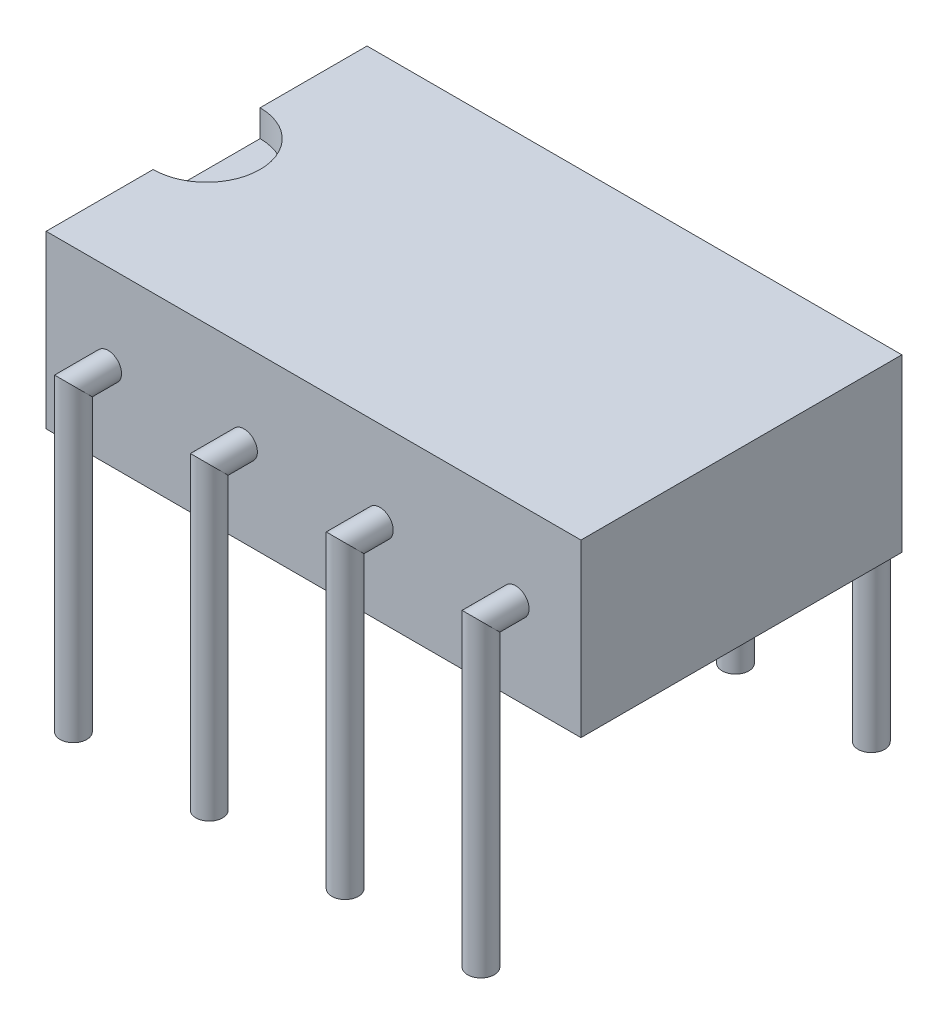
ISO-10303-21;
HEADER;
FILE_DESCRIPTION(('STEP AP214'),'2;1');
FILE_NAME('part.step','',(''),(''),'','','');
FILE_SCHEMA(('AUTOMOTIVE_DESIGN { 1 0 10303 214 1 1 1 1 }'));
ENDSEC;
DATA;
#1=APPLICATION_CONTEXT('core data for automotive mechanical design processes');
#2=APPLICATION_PROTOCOL_DEFINITION('international standard','automotive_design',2000,#1);
#3=PRODUCT_CONTEXT('',#1,'mechanical');
#4=PRODUCT('Part','Part','',(#3));
#5=PRODUCT_RELATED_PRODUCT_CATEGORY('part','',(#4));
#6=PRODUCT_DEFINITION_FORMATION('','',#4);
#7=PRODUCT_DEFINITION_CONTEXT('part definition',#1,'design');
#8=PRODUCT_DEFINITION('design','',#6,#7);
#9=PRODUCT_DEFINITION_SHAPE('','',#8);
#10=(LENGTH_UNIT() NAMED_UNIT(*) SI_UNIT(.MILLI.,.METRE.));
#11=(NAMED_UNIT(*) PLANE_ANGLE_UNIT() SI_UNIT($,.RADIAN.));
#12=(NAMED_UNIT(*) SI_UNIT($,.STERADIAN.) SOLID_ANGLE_UNIT());
#13=UNCERTAINTY_MEASURE_WITH_UNIT(LENGTH_MEASURE(1.E-05),#10,'distance_accuracy_value','');
#14=(GEOMETRIC_REPRESENTATION_CONTEXT(3) GLOBAL_UNCERTAINTY_ASSIGNED_CONTEXT((#13)) GLOBAL_UNIT_ASSIGNED_CONTEXT((#10,
#11,#12)) REPRESENTATION_CONTEXT('',''));
#15=CARTESIAN_POINT('',(0.,0.,0.));
#16=DIRECTION('',(0.,0.,1.));
#17=DIRECTION('',(1.,0.,0.));
#18=AXIS2_PLACEMENT_3D('',#15,#16,#17);
#19=CARTESIAN_POINT('',(10.,3.2,3.));
#20=DIRECTION('',(0.,0.,-1.));
#21=DIRECTION('',(-1.,0.,0.));
#22=AXIS2_PLACEMENT_3D('',#19,#20,#21);
#23=PLANE('',#22);
#24=CARTESIAN_POINT('',(6.24,1.6,3.));
#25=DIRECTION('',(0.,0.,-1.));
#26=DIRECTION('',(-1.,0.,0.));
#27=AXIS2_PLACEMENT_3D('',#24,#25,#26);
#28=CIRCLE('',#27,0.25);
#29=CARTESIAN_POINT('',(5.99,1.6,3.));
#30=VERTEX_POINT('',#29);
#31=EDGE_CURVE('E41',#30,#30,#28,.F.);
#32=ORIENTED_EDGE('',*,*,#31,.F.);
#33=EDGE_LOOP('',(#32));
#34=FACE_BOUND('',#33,.T.);
#35=CARTESIAN_POINT('',(1.16,1.6,3.));
#36=DIRECTION('',(0.,0.,1.));
#37=DIRECTION('',(1.,0.,0.));
#38=AXIS2_PLACEMENT_3D('',#35,#36,#37);
#39=CIRCLE('',#38,0.25);
#40=CARTESIAN_POINT('',(1.41,1.6,3.));
#41=VERTEX_POINT('',#40);
#42=EDGE_CURVE('E132',#41,#41,#39,.T.);
#43=ORIENTED_EDGE('',*,*,#42,.F.);
#44=EDGE_LOOP('',(#43));
#45=FACE_BOUND('',#44,.T.);
#46=DIRECTION('',(0.,-1.,0.));
#47=VECTOR('',#46,1.);
#48=CARTESIAN_POINT('',(0.,3.2,3.));
#49=LINE('',#48,#47);
#50=CARTESIAN_POINT('',(0.,3.2,3.));
#51=VERTEX_POINT('',#50);
#52=CARTESIAN_POINT('',(0.,0.,3.));
#53=VERTEX_POINT('',#52);
#54=EDGE_CURVE('E151',#51,#53,#49,.T.);
#55=ORIENTED_EDGE('',*,*,#54,.T.);
#56=DIRECTION('',(-1.,0.,0.));
#57=VECTOR('',#56,1.);
#58=CARTESIAN_POINT('',(10.,0.,3.));
#59=LINE('',#58,#57);
#60=CARTESIAN_POINT('',(10.,0.,3.));
#61=VERTEX_POINT('',#60);
#62=EDGE_CURVE('E129',#61,#53,#59,.T.);
#63=ORIENTED_EDGE('',*,*,#62,.F.);
#64=DIRECTION('',(0.,-1.,0.));
#65=VECTOR('',#64,1.);
#66=CARTESIAN_POINT('',(10.,3.2,3.));
#67=LINE('',#66,#65);
#68=CARTESIAN_POINT('',(10.,3.2,3.));
#69=VERTEX_POINT('',#68);
#70=EDGE_CURVE('E109',#69,#61,#67,.T.);
#71=ORIENTED_EDGE('',*,*,#70,.F.);
#72=DIRECTION('',(-1.,0.,0.));
#73=VECTOR('',#72,1.);
#74=CARTESIAN_POINT('',(10.,3.2,3.));
#75=LINE('',#74,#73);
#76=EDGE_CURVE('E122',#69,#51,#75,.T.);
#77=ORIENTED_EDGE('',*,*,#76,.T.);
#78=EDGE_LOOP('',(#55,#63,#71,#77));
#79=FACE_BOUND('',#78,.T.);
#80=CARTESIAN_POINT('',(3.7,1.6,3.));
#81=DIRECTION('',(0.,0.,-1.));
#82=DIRECTION('',(-1.,0.,0.));
#83=AXIS2_PLACEMENT_3D('',#80,#81,#82);
#84=CIRCLE('',#83,0.25);
#85=CARTESIAN_POINT('',(3.45,1.6,3.));
#86=VERTEX_POINT('',#85);
#87=EDGE_CURVE('E133',#86,#86,#84,.F.);
#88=ORIENTED_EDGE('',*,*,#87,.F.);
#89=EDGE_LOOP('',(#88));
#90=FACE_BOUND('',#89,.T.);
#91=CARTESIAN_POINT('',(8.78,1.6,3.));
#92=DIRECTION('',(0.,0.,-1.));
#93=DIRECTION('',(-1.,0.,0.));
#94=AXIS2_PLACEMENT_3D('',#91,#92,#93);
#95=CIRCLE('',#94,0.25);
#96=CARTESIAN_POINT('',(8.53,1.6,3.));
#97=VERTEX_POINT('',#96);
#98=EDGE_CURVE('E12',#97,#97,#95,.F.);
#99=ORIENTED_EDGE('',*,*,#98,.F.);
#100=EDGE_LOOP('',(#99));
#101=FACE_BOUND('',#100,.T.);
#102=ADVANCED_FACE('F34',(#34,#45,#79,#90,#101),#23,.F.);
#103=CARTESIAN_POINT('',(10.,0.,3.));
#104=DIRECTION('',(0.,1.,0.));
#105=DIRECTION('',(0.,0.,1.));
#106=AXIS2_PLACEMENT_3D('',#103,#104,#105);
#107=PLANE('',#106);
#108=DIRECTION('',(0.,0.,-1.));
#109=VECTOR('',#108,1.);
#110=CARTESIAN_POINT('',(0.,0.,3.));
#111=LINE('',#110,#109);
#112=CARTESIAN_POINT('',(0.,0.,-3.));
#113=VERTEX_POINT('',#112);
#114=EDGE_CURVE('E206',#53,#113,#111,.T.);
#115=ORIENTED_EDGE('',*,*,#114,.T.);
#116=DIRECTION('',(-1.,0.,0.));
#117=VECTOR('',#116,1.);
#118=CARTESIAN_POINT('',(10.,0.,-3.));
#119=LINE('',#118,#117);
#120=CARTESIAN_POINT('',(10.,0.,-3.));
#121=VERTEX_POINT('',#120);
#122=EDGE_CURVE('E126',#121,#113,#119,.T.);
#123=ORIENTED_EDGE('',*,*,#122,.F.);
#124=DIRECTION('',(0.,0.,-1.));
#125=VECTOR('',#124,1.);
#126=CARTESIAN_POINT('',(10.,0.,3.));
#127=LINE('',#126,#125);
#128=EDGE_CURVE('E112',#61,#121,#127,.T.);
#129=ORIENTED_EDGE('',*,*,#128,.F.);
#130=ORIENTED_EDGE('',*,*,#62,.T.);
#131=EDGE_LOOP('',(#115,#123,#129,#130));
#132=FACE_BOUND('',#131,.T.);
#133=ADVANCED_FACE('F143',(#132),#107,.F.);
#134=CARTESIAN_POINT('',(10.,3.2,-3.));
#135=DIRECTION('',(0.,0.,1.));
#136=DIRECTION('',(1.,0.,0.));
#137=AXIS2_PLACEMENT_3D('',#134,#135,#136);
#138=PLANE('',#137);
#139=CARTESIAN_POINT('',(8.78,1.6,-3.));
#140=DIRECTION('',(0.,0.,1.));
#141=DIRECTION('',(1.,0.,0.));
#142=AXIS2_PLACEMENT_3D('',#139,#140,#141);
#143=CIRCLE('',#142,0.25);
#144=CARTESIAN_POINT('',(9.03,1.6,-3.));
#145=VERTEX_POINT('',#144);
#146=EDGE_CURVE('E455',#145,#145,#143,.T.);
#147=ORIENTED_EDGE('',*,*,#146,.T.);
#148=EDGE_LOOP('',(#147));
#149=FACE_BOUND('',#148,.T.);
#150=CARTESIAN_POINT('',(6.24,1.6,-3.));
#151=DIRECTION('',(0.,0.,1.));
#152=DIRECTION('',(1.,0.,0.));
#153=AXIS2_PLACEMENT_3D('',#150,#151,#152);
#154=CIRCLE('',#153,0.25);
#155=CARTESIAN_POINT('',(6.49,1.6,-3.));
#156=VERTEX_POINT('',#155);
#157=EDGE_CURVE('E448',#156,#156,#154,.T.);
#158=ORIENTED_EDGE('',*,*,#157,.T.);
#159=EDGE_LOOP('',(#158));
#160=FACE_BOUND('',#159,.T.);
#161=CARTESIAN_POINT('',(3.7,1.6,-3.));
#162=DIRECTION('',(0.,0.,1.));
#163=DIRECTION('',(1.,0.,0.));
#164=AXIS2_PLACEMENT_3D('',#161,#162,#163);
#165=CIRCLE('',#164,0.25);
#166=CARTESIAN_POINT('',(3.95,1.6,-3.));
#167=VERTEX_POINT('',#166);
#168=EDGE_CURVE('E464',#167,#167,#165,.T.);
#169=ORIENTED_EDGE('',*,*,#168,.T.);
#170=EDGE_LOOP('',(#169));
#171=FACE_BOUND('',#170,.T.);
#172=CARTESIAN_POINT('',(1.16,1.6,-3.));
#173=DIRECTION('',(0.,0.,1.));
#174=DIRECTION('',(1.,0.,0.));
#175=AXIS2_PLACEMENT_3D('',#172,#173,#174);
#176=CIRCLE('',#175,0.25);
#177=CARTESIAN_POINT('',(1.41,1.6,-3.));
#178=VERTEX_POINT('',#177);
#179=EDGE_CURVE('E188',#178,#178,#176,.T.);
#180=ORIENTED_EDGE('',*,*,#179,.T.);
#181=EDGE_LOOP('',(#180));
#182=FACE_BOUND('',#181,.T.);
#183=DIRECTION('',(0.,1.,0.));
#184=VECTOR('',#183,1.);
#185=CARTESIAN_POINT('',(0.,3.2,-3.));
#186=LINE('',#185,#184);
#187=CARTESIAN_POINT('',(0.,3.2,-3.));
#188=VERTEX_POINT('',#187);
#189=EDGE_CURVE('E114',#113,#188,#186,.T.);
#190=ORIENTED_EDGE('',*,*,#189,.T.);
#191=DIRECTION('',(-1.,0.,0.));
#192=VECTOR('',#191,1.);
#193=CARTESIAN_POINT('',(10.,3.2,-3.));
#194=LINE('',#193,#192);
#195=CARTESIAN_POINT('',(10.,3.2,-3.));
#196=VERTEX_POINT('',#195);
#197=EDGE_CURVE('E108',#196,#188,#194,.T.);
#198=ORIENTED_EDGE('',*,*,#197,.F.);
#199=DIRECTION('',(0.,1.,0.));
#200=VECTOR('',#199,1.);
#201=CARTESIAN_POINT('',(10.,3.2,-3.));
#202=LINE('',#201,#200);
#203=EDGE_CURVE('E119',#121,#196,#202,.T.);
#204=ORIENTED_EDGE('',*,*,#203,.F.);
#205=ORIENTED_EDGE('',*,*,#122,.T.);
#206=EDGE_LOOP('',(#190,#198,#204,#205));
#207=FACE_BOUND('',#206,.T.);
#208=ADVANCED_FACE('F210',(#149,#160,#171,#182,#207),#138,.F.);
#209=CARTESIAN_POINT('',(10.,3.2,3.));
#210=DIRECTION('',(0.,-1.,0.));
#211=DIRECTION('',(0.,0.,-1.));
#212=AXIS2_PLACEMENT_3D('',#209,#210,#211);
#213=PLANE('',#212);
#214=DIRECTION('',(0.,0.,1.));
#215=VECTOR('',#214,1.);
#216=CARTESIAN_POINT('',(0.,3.2,3.));
#217=LINE('',#216,#215);
#218=CARTESIAN_POINT('',(0.,3.2,-1.));
#219=VERTEX_POINT('',#218);
#220=EDGE_CURVE('E102',#188,#219,#217,.T.);
#221=ORIENTED_EDGE('',*,*,#220,.T.);
#222=CARTESIAN_POINT('',(0.,3.2,0.));
#223=DIRECTION('',(0.,1.,0.));
#224=DIRECTION('',(0.,0.,1.));
#225=AXIS2_PLACEMENT_3D('',#222,#223,#224);
#226=CIRCLE('',#225,1.);
#227=CARTESIAN_POINT('',(0.,3.2,1.));
#228=VERTEX_POINT('',#227);
#229=EDGE_CURVE('E86',#228,#219,#226,.T.);
#230=ORIENTED_EDGE('',*,*,#229,.F.);
#231=EDGE_CURVE('E110',#228,#51,#217,.T.);
#232=ORIENTED_EDGE('',*,*,#231,.T.);
#233=ORIENTED_EDGE('',*,*,#76,.F.);
#234=DIRECTION('',(0.,0.,1.));
#235=VECTOR('',#234,1.);
#236=CARTESIAN_POINT('',(10.,3.2,3.));
#237=LINE('',#236,#235);
#238=EDGE_CURVE('E55',#196,#69,#237,.T.);
#239=ORIENTED_EDGE('',*,*,#238,.F.);
#240=ORIENTED_EDGE('',*,*,#197,.T.);
#241=EDGE_LOOP('',(#221,#230,#232,#233,#239,#240));
#242=FACE_BOUND('',#241,.T.);
#243=ADVANCED_FACE('F106',(#242),#213,.F.);
#244=CARTESIAN_POINT('',(10.,0.,3.));
#245=DIRECTION('',(1.,0.,0.));
#246=DIRECTION('',(0.,0.,-1.));
#247=AXIS2_PLACEMENT_3D('',#244,#245,#246);
#248=PLANE('',#247);
#249=ORIENTED_EDGE('',*,*,#70,.T.);
#250=ORIENTED_EDGE('',*,*,#128,.T.);
#251=ORIENTED_EDGE('',*,*,#203,.T.);
#252=ORIENTED_EDGE('',*,*,#238,.T.);
#253=EDGE_LOOP('',(#249,#250,#251,#252));
#254=FACE_BOUND('',#253,.T.);
#255=ADVANCED_FACE('F213',(#254),#248,.T.);
#256=CARTESIAN_POINT('',(0.,0.,3.));
#257=DIRECTION('',(1.,0.,0.));
#258=DIRECTION('',(0.,0.,-1.));
#259=AXIS2_PLACEMENT_3D('',#256,#257,#258);
#260=PLANE('',#259);
#261=DIRECTION('',(0.,0.,1.));
#262=VECTOR('',#261,1.);
#263=CARTESIAN_POINT('',(0.,2.7,-1.));
#264=LINE('',#263,#262);
#265=CARTESIAN_POINT('',(0.,2.7,-1.));
#266=VERTEX_POINT('',#265);
#267=CARTESIAN_POINT('',(0.,2.7,1.));
#268=VERTEX_POINT('',#267);
#269=EDGE_CURVE('E103',#266,#268,#264,.T.);
#270=ORIENTED_EDGE('',*,*,#269,.F.);
#271=DIRECTION('',(0.,1.,0.));
#272=VECTOR('',#271,1.);
#273=CARTESIAN_POINT('',(0.,2.7,-1.));
#274=LINE('',#273,#272);
#275=EDGE_CURVE('E89',#266,#219,#274,.T.);
#276=ORIENTED_EDGE('',*,*,#275,.T.);
#277=ORIENTED_EDGE('',*,*,#220,.F.);
#278=ORIENTED_EDGE('',*,*,#189,.F.);
#279=ORIENTED_EDGE('',*,*,#114,.F.);
#280=ORIENTED_EDGE('',*,*,#54,.F.);
#281=ORIENTED_EDGE('',*,*,#231,.F.);
#282=DIRECTION('',(0.,1.,0.));
#283=VECTOR('',#282,1.);
#284=CARTESIAN_POINT('',(0.,2.7,1.));
#285=LINE('',#284,#283);
#286=EDGE_CURVE('E92',#268,#228,#285,.T.);
#287=ORIENTED_EDGE('',*,*,#286,.F.);
#288=EDGE_LOOP('',(#270,#276,#277,#278,#279,#280,#281,#287));
#289=FACE_BOUND('',#288,.T.);
#290=ADVANCED_FACE('F100',(#289),#260,.F.);
#291=CARTESIAN_POINT('',(0.,2.7,0.));
#292=DIRECTION('',(0.,1.,0.));
#293=DIRECTION('',(0.,0.,1.));
#294=AXIS2_PLACEMENT_3D('',#291,#292,#293);
#295=CYLINDRICAL_SURFACE('',#294,1.);
#296=ORIENTED_EDGE('',*,*,#229,.T.);
#297=ORIENTED_EDGE('',*,*,#275,.F.);
#298=CARTESIAN_POINT('',(0.,2.7,0.));
#299=DIRECTION('',(0.,1.,0.));
#300=DIRECTION('',(0.,0.,1.));
#301=AXIS2_PLACEMENT_3D('',#298,#299,#300);
#302=CIRCLE('',#301,1.);
#303=EDGE_CURVE('E47',#268,#266,#302,.T.);
#304=ORIENTED_EDGE('',*,*,#303,.F.);
#305=ORIENTED_EDGE('',*,*,#286,.T.);
#306=EDGE_LOOP('',(#296,#297,#304,#305));
#307=FACE_BOUND('',#306,.T.);
#308=ADVANCED_FACE('F88',(#307),#295,.F.);
#309=CARTESIAN_POINT('',(0.,2.7,0.));
#310=DIRECTION('',(0.,1.,0.));
#311=DIRECTION('',(0.,0.,1.));
#312=AXIS2_PLACEMENT_3D('',#309,#310,#311);
#313=PLANE('',#312);
#314=ORIENTED_EDGE('',*,*,#303,.T.);
#315=ORIENTED_EDGE('',*,*,#269,.T.);
#316=EDGE_LOOP('',(#314,#315));
#317=FACE_BOUND('',#316,.T.);
#318=ADVANCED_FACE('F251',(#317),#313,.T.);
#319=CARTESIAN_POINT('',(1.16,1.6,3.65));
#320=DIRECTION('',(0.,-1.,0.));
#321=DIRECTION('',(0.,0.,-1.));
#322=AXIS2_PLACEMENT_3D('',#319,#320,#321);
#323=CYLINDRICAL_SURFACE('',#322,0.25);
#324=CARTESIAN_POINT('',(1.16,1.6,3.65));
#325=DIRECTION('',(0.,-0.707106781186548,0.707106781186547));
#326=DIRECTION('',(0.,-0.707106781186547,-0.707106781186548));
#327=AXIS2_PLACEMENT_3D('',#324,#325,#326);
#328=ELLIPSE('',#327,0.353553390593274,0.25);
#329=CARTESIAN_POINT('',(1.16,1.35,3.4));
#330=VERTEX_POINT('',#329);
#331=EDGE_CURVE('E197',#330,#330,#328,.T.);
#332=ORIENTED_EDGE('',*,*,#331,.T.);
#333=EDGE_LOOP('',(#332));
#334=FACE_BOUND('',#333,.T.);
#335=CARTESIAN_POINT('',(1.16,-4.,3.65));
#336=DIRECTION('',(0.,-1.,0.));
#337=DIRECTION('',(0.,0.,-1.));
#338=AXIS2_PLACEMENT_3D('',#335,#336,#337);
#339=CIRCLE('',#338,0.25);
#340=CARTESIAN_POINT('',(1.16,-4.,3.4));
#341=VERTEX_POINT('',#340);
#342=EDGE_CURVE('E96',#341,#341,#339,.F.);
#343=ORIENTED_EDGE('',*,*,#342,.T.);
#344=EDGE_LOOP('',(#343));
#345=FACE_BOUND('',#344,.T.);
#346=ADVANCED_FACE('F257',(#334,#345),#323,.T.);
#347=CARTESIAN_POINT('',(1.16,1.6,4.35710678118655));
#348=DIRECTION('',(0.,0.,-1.));
#349=DIRECTION('',(0.,1.,0.));
#350=AXIS2_PLACEMENT_3D('',#347,#348,#349);
#351=CYLINDRICAL_SURFACE('',#350,0.25);
#352=ORIENTED_EDGE('',*,*,#42,.T.);
#353=EDGE_LOOP('',(#352));
#354=FACE_BOUND('',#353,.T.);
#355=ORIENTED_EDGE('',*,*,#331,.F.);
#356=EDGE_LOOP('',(#355));
#357=FACE_BOUND('',#356,.T.);
#358=ADVANCED_FACE('F264',(#354,#357),#351,.T.);
#359=CARTESIAN_POINT('',(1.16,-4.,3.65));
#360=DIRECTION('',(0.,-1.,0.));
#361=DIRECTION('',(0.,0.,-1.));
#362=AXIS2_PLACEMENT_3D('',#359,#360,#361);
#363=PLANE('',#362);
#364=ORIENTED_EDGE('',*,*,#342,.F.);
#365=EDGE_LOOP('',(#364));
#366=FACE_BOUND('',#365,.T.);
#367=ADVANCED_FACE('F272',(#366),#363,.T.);
#368=CARTESIAN_POINT('',(1.16,1.6,-3.65));
#369=DIRECTION('',(0.,-1.,0.));
#370=DIRECTION('',(0.,0.,-1.));
#371=AXIS2_PLACEMENT_3D('',#368,#369,#370);
#372=CYLINDRICAL_SURFACE('',#371,0.25);
#373=CARTESIAN_POINT('',(1.16,1.6,-3.65));
#374=DIRECTION('',(0.,-0.707106781186548,-0.707106781186547));
#375=DIRECTION('',(0.,-0.707106781186547,0.707106781186548));
#376=AXIS2_PLACEMENT_3D('',#373,#374,#375);
#377=ELLIPSE('',#376,0.353553390593274,0.25);
#378=CARTESIAN_POINT('',(1.16,1.35,-3.4));
#379=VERTEX_POINT('',#378);
#380=EDGE_CURVE('E191',#379,#379,#377,.F.);
#381=ORIENTED_EDGE('',*,*,#380,.F.);
#382=EDGE_LOOP('',(#381));
#383=FACE_BOUND('',#382,.T.);
#384=CARTESIAN_POINT('',(1.16,-4.,-3.65));
#385=DIRECTION('',(0.,-1.,0.));
#386=DIRECTION('',(0.,0.,-1.));
#387=AXIS2_PLACEMENT_3D('',#384,#385,#386);
#388=CIRCLE('',#387,0.25);
#389=CARTESIAN_POINT('',(1.16,-4.,-3.9));
#390=VERTEX_POINT('',#389);
#391=EDGE_CURVE('E194',#390,#390,#388,.T.);
#392=ORIENTED_EDGE('',*,*,#391,.F.);
#393=EDGE_LOOP('',(#392));
#394=FACE_BOUND('',#393,.T.);
#395=ADVANCED_FACE('F280',(#383,#394),#372,.T.);
#396=CARTESIAN_POINT('',(1.16,1.6,-4.35710678118655));
#397=DIRECTION('',(0.,0.,1.));
#398=DIRECTION('',(0.,-1.,0.));
#399=AXIS2_PLACEMENT_3D('',#396,#397,#398);
#400=CYLINDRICAL_SURFACE('',#399,0.25);
#401=ORIENTED_EDGE('',*,*,#179,.F.);
#402=EDGE_LOOP('',(#401));
#403=FACE_BOUND('',#402,.T.);
#404=ORIENTED_EDGE('',*,*,#380,.T.);
#405=EDGE_LOOP('',(#404));
#406=FACE_BOUND('',#405,.T.);
#407=ADVANCED_FACE('F288',(#403,#406),#400,.T.);
#408=CARTESIAN_POINT('',(1.16,-4.,-3.65));
#409=DIRECTION('',(0.,-1.,0.));
#410=DIRECTION('',(0.,0.,-1.));
#411=AXIS2_PLACEMENT_3D('',#408,#409,#410);
#412=PLANE('',#411);
#413=ORIENTED_EDGE('',*,*,#391,.T.);
#414=EDGE_LOOP('',(#413));
#415=FACE_BOUND('',#414,.T.);
#416=ADVANCED_FACE('F296',(#415),#412,.T.);
#417=CARTESIAN_POINT('',(3.7,1.6,3.65));
#418=DIRECTION('',(0.,-1.,0.));
#419=DIRECTION('',(0.,0.,-1.));
#420=AXIS2_PLACEMENT_3D('',#417,#418,#419);
#421=CYLINDRICAL_SURFACE('',#420,0.25);
#422=CARTESIAN_POINT('',(3.7,1.6,3.65));
#423=DIRECTION('',(0.,-0.707106781186548,0.707106781186547));
#424=DIRECTION('',(0.,-0.707106781186547,-0.707106781186548));
#425=AXIS2_PLACEMENT_3D('',#422,#423,#424);
#426=ELLIPSE('',#425,0.353553390593274,0.25);
#427=CARTESIAN_POINT('',(3.7,1.35,3.4));
#428=VERTEX_POINT('',#427);
#429=EDGE_CURVE('E182',#428,#428,#426,.T.);
#430=ORIENTED_EDGE('',*,*,#429,.T.);
#431=EDGE_LOOP('',(#430));
#432=FACE_BOUND('',#431,.T.);
#433=CARTESIAN_POINT('',(3.7,-4.,3.65));
#434=DIRECTION('',(0.,-1.,0.));
#435=DIRECTION('',(0.,0.,-1.));
#436=AXIS2_PLACEMENT_3D('',#433,#434,#435);
#437=CIRCLE('',#436,0.25);
#438=CARTESIAN_POINT('',(3.7,-4.,3.4));
#439=VERTEX_POINT('',#438);
#440=EDGE_CURVE('E185',#439,#439,#437,.F.);
#441=ORIENTED_EDGE('',*,*,#440,.T.);
#442=EDGE_LOOP('',(#441));
#443=FACE_BOUND('',#442,.T.);
#444=ADVANCED_FACE('F304',(#432,#443),#421,.T.);
#445=CARTESIAN_POINT('',(3.7,1.6,4.35710678118655));
#446=DIRECTION('',(0.,0.,-1.));
#447=DIRECTION('',(0.,1.,0.));
#448=AXIS2_PLACEMENT_3D('',#445,#446,#447);
#449=CYLINDRICAL_SURFACE('',#448,0.25);
#450=ORIENTED_EDGE('',*,*,#87,.T.);
#451=EDGE_LOOP('',(#450));
#452=FACE_BOUND('',#451,.T.);
#453=ORIENTED_EDGE('',*,*,#429,.F.);
#454=EDGE_LOOP('',(#453));
#455=FACE_BOUND('',#454,.T.);
#456=ADVANCED_FACE('F315',(#452,#455),#449,.T.);
#457=CARTESIAN_POINT('',(3.7,-4.,3.65));
#458=DIRECTION('',(0.,-1.,0.));
#459=DIRECTION('',(0.,0.,-1.));
#460=AXIS2_PLACEMENT_3D('',#457,#458,#459);
#461=PLANE('',#460);
#462=ORIENTED_EDGE('',*,*,#440,.F.);
#463=EDGE_LOOP('',(#462));
#464=FACE_BOUND('',#463,.T.);
#465=ADVANCED_FACE('F323',(#464),#461,.T.);
#466=CARTESIAN_POINT('',(6.24,1.6,3.65));
#467=DIRECTION('',(0.,-1.,0.));
#468=DIRECTION('',(0.,0.,-1.));
#469=AXIS2_PLACEMENT_3D('',#466,#467,#468);
#470=CYLINDRICAL_SURFACE('',#469,0.25);
#471=CARTESIAN_POINT('',(6.24,1.6,3.65));
#472=DIRECTION('',(0.,-0.707106781186548,0.707106781186547));
#473=DIRECTION('',(0.,-0.707106781186547,-0.707106781186548));
#474=AXIS2_PLACEMENT_3D('',#471,#472,#473);
#475=ELLIPSE('',#474,0.353553390593274,0.25);
#476=CARTESIAN_POINT('',(6.24,1.35,3.4));
#477=VERTEX_POINT('',#476);
#478=EDGE_CURVE('E170',#477,#477,#475,.T.);
#479=ORIENTED_EDGE('',*,*,#478,.T.);
#480=EDGE_LOOP('',(#479));
#481=FACE_BOUND('',#480,.T.);
#482=CARTESIAN_POINT('',(6.24,-4.,3.65));
#483=DIRECTION('',(0.,-1.,0.));
#484=DIRECTION('',(0.,0.,-1.));
#485=AXIS2_PLACEMENT_3D('',#482,#483,#484);
#486=CIRCLE('',#485,0.25);
#487=CARTESIAN_POINT('',(6.24,-4.,3.4));
#488=VERTEX_POINT('',#487);
#489=EDGE_CURVE('E179',#488,#488,#486,.F.);
#490=ORIENTED_EDGE('',*,*,#489,.T.);
#491=EDGE_LOOP('',(#490));
#492=FACE_BOUND('',#491,.T.);
#493=ADVANCED_FACE('F331',(#481,#492),#470,.T.);
#494=CARTESIAN_POINT('',(6.24,1.6,4.35710678118655));
#495=DIRECTION('',(0.,0.,-1.));
#496=DIRECTION('',(0.,1.,0.));
#497=AXIS2_PLACEMENT_3D('',#494,#495,#496);
#498=CYLINDRICAL_SURFACE('',#497,0.25);
#499=ORIENTED_EDGE('',*,*,#31,.T.);
#500=EDGE_LOOP('',(#499));
#501=FACE_BOUND('',#500,.T.);
#502=ORIENTED_EDGE('',*,*,#478,.F.);
#503=EDGE_LOOP('',(#502));
#504=FACE_BOUND('',#503,.T.);
#505=ADVANCED_FACE('F138',(#501,#504),#498,.T.);
#506=CARTESIAN_POINT('',(6.24,-4.,3.65));
#507=DIRECTION('',(0.,-1.,0.));
#508=DIRECTION('',(0.,0.,-1.));
#509=AXIS2_PLACEMENT_3D('',#506,#507,#508);
#510=PLANE('',#509);
#511=ORIENTED_EDGE('',*,*,#489,.F.);
#512=EDGE_LOOP('',(#511));
#513=FACE_BOUND('',#512,.T.);
#514=ADVANCED_FACE('F346',(#513),#510,.T.);
#515=CARTESIAN_POINT('',(8.78,1.6,3.65));
#516=DIRECTION('',(0.,-1.,0.));
#517=DIRECTION('',(0.,0.,-1.));
#518=AXIS2_PLACEMENT_3D('',#515,#516,#517);
#519=CYLINDRICAL_SURFACE('',#518,0.25);
#520=CARTESIAN_POINT('',(8.78,1.6,3.65));
#521=DIRECTION('',(0.,-0.707106781186548,0.707106781186547));
#522=DIRECTION('',(0.,-0.707106781186547,-0.707106781186548));
#523=AXIS2_PLACEMENT_3D('',#520,#521,#522);
#524=ELLIPSE('',#523,0.353553390593274,0.25);
#525=CARTESIAN_POINT('',(8.78,1.35,3.4));
#526=VERTEX_POINT('',#525);
#527=EDGE_CURVE('E164',#526,#526,#524,.T.);
#528=ORIENTED_EDGE('',*,*,#527,.T.);
#529=EDGE_LOOP('',(#528));
#530=FACE_BOUND('',#529,.T.);
#531=CARTESIAN_POINT('',(8.78,-4.,3.65));
#532=DIRECTION('',(0.,-1.,0.));
#533=DIRECTION('',(0.,0.,-1.));
#534=AXIS2_PLACEMENT_3D('',#531,#532,#533);
#535=CIRCLE('',#534,0.25);
#536=CARTESIAN_POINT('',(8.78,-4.,3.4));
#537=VERTEX_POINT('',#536);
#538=EDGE_CURVE('E166',#537,#537,#535,.F.);
#539=ORIENTED_EDGE('',*,*,#538,.T.);
#540=EDGE_LOOP('',(#539));
#541=FACE_BOUND('',#540,.T.);
#542=ADVANCED_FACE('F160',(#530,#541),#519,.T.);
#543=CARTESIAN_POINT('',(8.78,1.6,4.35710678118655));
#544=DIRECTION('',(0.,0.,-1.));
#545=DIRECTION('',(0.,1.,0.));
#546=AXIS2_PLACEMENT_3D('',#543,#544,#545);
#547=CYLINDRICAL_SURFACE('',#546,0.25);
#548=ORIENTED_EDGE('',*,*,#98,.T.);
#549=EDGE_LOOP('',(#548));
#550=FACE_BOUND('',#549,.T.);
#551=ORIENTED_EDGE('',*,*,#527,.F.);
#552=EDGE_LOOP('',(#551));
#553=FACE_BOUND('',#552,.T.);
#554=ADVANCED_FACE('F156',(#550,#553),#547,.T.);
#555=CARTESIAN_POINT('',(8.78,-4.,3.65));
#556=DIRECTION('',(0.,-1.,0.));
#557=DIRECTION('',(0.,0.,-1.));
#558=AXIS2_PLACEMENT_3D('',#555,#556,#557);
#559=PLANE('',#558);
#560=ORIENTED_EDGE('',*,*,#538,.F.);
#561=EDGE_LOOP('',(#560));
#562=FACE_BOUND('',#561,.T.);
#563=ADVANCED_FACE('F159',(#562),#559,.T.);
#564=CARTESIAN_POINT('',(3.7,1.6,-3.65));
#565=DIRECTION('',(0.,-1.,0.));
#566=DIRECTION('',(0.,0.,-1.));
#567=AXIS2_PLACEMENT_3D('',#564,#565,#566);
#568=CYLINDRICAL_SURFACE('',#567,0.25);
#569=CARTESIAN_POINT('',(3.7,1.6,-3.65));
#570=DIRECTION('',(0.,-0.707106781186548,-0.707106781186547));
#571=DIRECTION('',(0.,-0.707106781186547,0.707106781186548));
#572=AXIS2_PLACEMENT_3D('',#569,#570,#571);
#573=ELLIPSE('',#572,0.353553390593274,0.25);
#574=CARTESIAN_POINT('',(3.7,1.35,-3.4));
#575=VERTEX_POINT('',#574);
#576=EDGE_CURVE('E173',#575,#575,#573,.F.);
#577=ORIENTED_EDGE('',*,*,#576,.F.);
#578=EDGE_LOOP('',(#577));
#579=FACE_BOUND('',#578,.T.);
#580=CARTESIAN_POINT('',(3.7,-4.,-3.65));
#581=DIRECTION('',(0.,-1.,0.));
#582=DIRECTION('',(0.,0.,-1.));
#583=AXIS2_PLACEMENT_3D('',#580,#581,#582);
#584=CIRCLE('',#583,0.25);
#585=CARTESIAN_POINT('',(3.7,-4.,-3.9));
#586=VERTEX_POINT('',#585);
#587=EDGE_CURVE('E167',#586,#586,#584,.T.);
#588=ORIENTED_EDGE('',*,*,#587,.F.);
#589=EDGE_LOOP('',(#588));
#590=FACE_BOUND('',#589,.T.);
#591=ADVANCED_FACE('F370',(#579,#590),#568,.T.);
#592=CARTESIAN_POINT('',(3.7,1.6,-4.35710678118655));
#593=DIRECTION('',(0.,0.,1.));
#594=DIRECTION('',(0.,-1.,0.));
#595=AXIS2_PLACEMENT_3D('',#592,#593,#594);
#596=CYLINDRICAL_SURFACE('',#595,0.25);
#597=ORIENTED_EDGE('',*,*,#168,.F.);
#598=EDGE_LOOP('',(#597));
#599=FACE_BOUND('',#598,.T.);
#600=ORIENTED_EDGE('',*,*,#576,.T.);
#601=EDGE_LOOP('',(#600));
#602=FACE_BOUND('',#601,.T.);
#603=ADVANCED_FACE('F378',(#599,#602),#596,.T.);
#604=CARTESIAN_POINT('',(3.7,-4.,-3.65));
#605=DIRECTION('',(0.,-1.,0.));
#606=DIRECTION('',(0.,0.,-1.));
#607=AXIS2_PLACEMENT_3D('',#604,#605,#606);
#608=PLANE('',#607);
#609=ORIENTED_EDGE('',*,*,#587,.T.);
#610=EDGE_LOOP('',(#609));
#611=FACE_BOUND('',#610,.T.);
#612=ADVANCED_FACE('F386',(#611),#608,.T.);
#613=CARTESIAN_POINT('',(6.24,1.6,-3.65));
#614=DIRECTION('',(0.,-1.,0.));
#615=DIRECTION('',(0.,0.,-1.));
#616=AXIS2_PLACEMENT_3D('',#613,#614,#615);
#617=CYLINDRICAL_SURFACE('',#616,0.25);
#618=CARTESIAN_POINT('',(6.24,1.6,-3.65));
#619=DIRECTION('',(0.,-0.707106781186548,-0.707106781186547));
#620=DIRECTION('',(0.,-0.707106781186547,0.707106781186548));
#621=AXIS2_PLACEMENT_3D('',#618,#619,#620);
#622=ELLIPSE('',#621,0.353553390593274,0.25);
#623=CARTESIAN_POINT('',(6.24,1.35,-3.4));
#624=VERTEX_POINT('',#623);
#625=EDGE_CURVE('E452',#624,#624,#622,.F.);
#626=ORIENTED_EDGE('',*,*,#625,.F.);
#627=EDGE_LOOP('',(#626));
#628=FACE_BOUND('',#627,.T.);
#629=CARTESIAN_POINT('',(6.24,-4.,-3.65));
#630=DIRECTION('',(0.,-1.,0.));
#631=DIRECTION('',(0.,0.,-1.));
#632=AXIS2_PLACEMENT_3D('',#629,#630,#631);
#633=CIRCLE('',#632,0.25);
#634=CARTESIAN_POINT('',(6.24,-4.,-3.9));
#635=VERTEX_POINT('',#634);
#636=EDGE_CURVE('E461',#635,#635,#633,.T.);
#637=ORIENTED_EDGE('',*,*,#636,.F.);
#638=EDGE_LOOP('',(#637));
#639=FACE_BOUND('',#638,.T.);
#640=ADVANCED_FACE('F394',(#628,#639),#617,.T.);
#641=CARTESIAN_POINT('',(6.24,1.6,-4.35710678118655));
#642=DIRECTION('',(0.,0.,1.));
#643=DIRECTION('',(0.,-1.,0.));
#644=AXIS2_PLACEMENT_3D('',#641,#642,#643);
#645=CYLINDRICAL_SURFACE('',#644,0.25);
#646=ORIENTED_EDGE('',*,*,#157,.F.);
#647=EDGE_LOOP('',(#646));
#648=FACE_BOUND('',#647,.T.);
#649=ORIENTED_EDGE('',*,*,#625,.T.);
#650=EDGE_LOOP('',(#649));
#651=FACE_BOUND('',#650,.T.);
#652=ADVANCED_FACE('F402',(#648,#651),#645,.T.);
#653=CARTESIAN_POINT('',(6.24,-4.,-3.65));
#654=DIRECTION('',(0.,-1.,0.));
#655=DIRECTION('',(0.,0.,-1.));
#656=AXIS2_PLACEMENT_3D('',#653,#654,#655);
#657=PLANE('',#656);
#658=ORIENTED_EDGE('',*,*,#636,.T.);
#659=EDGE_LOOP('',(#658));
#660=FACE_BOUND('',#659,.T.);
#661=ADVANCED_FACE('F410',(#660),#657,.T.);
#662=CARTESIAN_POINT('',(8.78,1.6,-3.65));
#663=DIRECTION('',(0.,-1.,0.));
#664=DIRECTION('',(0.,0.,-1.));
#665=AXIS2_PLACEMENT_3D('',#662,#663,#664);
#666=CYLINDRICAL_SURFACE('',#665,0.25);
#667=CARTESIAN_POINT('',(8.78,1.6,-3.65));
#668=DIRECTION('',(0.,-0.707106781186548,-0.707106781186547));
#669=DIRECTION('',(0.,-0.707106781186547,0.707106781186548));
#670=AXIS2_PLACEMENT_3D('',#667,#668,#669);
#671=ELLIPSE('',#670,0.353553390593274,0.25);
#672=CARTESIAN_POINT('',(8.78,1.35,-3.4));
#673=VERTEX_POINT('',#672);
#674=EDGE_CURVE('E449',#673,#673,#671,.F.);
#675=ORIENTED_EDGE('',*,*,#674,.F.);
#676=EDGE_LOOP('',(#675));
#677=FACE_BOUND('',#676,.T.);
#678=CARTESIAN_POINT('',(8.78,-4.,-3.65));
#679=DIRECTION('',(0.,-1.,0.));
#680=DIRECTION('',(0.,0.,-1.));
#681=AXIS2_PLACEMENT_3D('',#678,#679,#680);
#682=CIRCLE('',#681,0.25);
#683=CARTESIAN_POINT('',(8.78,-4.,-3.9));
#684=VERTEX_POINT('',#683);
#685=EDGE_CURVE('E446',#684,#684,#682,.T.);
#686=ORIENTED_EDGE('',*,*,#685,.F.);
#687=EDGE_LOOP('',(#686));
#688=FACE_BOUND('',#687,.T.);
#689=ADVANCED_FACE('F418',(#677,#688),#666,.T.);
#690=CARTESIAN_POINT('',(8.78,1.6,-4.35710678118655));
#691=DIRECTION('',(0.,0.,1.));
#692=DIRECTION('',(0.,-1.,0.));
#693=AXIS2_PLACEMENT_3D('',#690,#691,#692);
#694=CYLINDRICAL_SURFACE('',#693,0.25);
#695=ORIENTED_EDGE('',*,*,#146,.F.);
#696=EDGE_LOOP('',(#695));
#697=FACE_BOUND('',#696,.T.);
#698=ORIENTED_EDGE('',*,*,#674,.T.);
#699=EDGE_LOOP('',(#698));
#700=FACE_BOUND('',#699,.T.);
#701=ADVANCED_FACE('F426',(#697,#700),#694,.T.);
#702=CARTESIAN_POINT('',(8.78,-4.,-3.65));
#703=DIRECTION('',(0.,-1.,0.));
#704=DIRECTION('',(0.,0.,-1.));
#705=AXIS2_PLACEMENT_3D('',#702,#703,#704);
#706=PLANE('',#705);
#707=ORIENTED_EDGE('',*,*,#685,.T.);
#708=EDGE_LOOP('',(#707));
#709=FACE_BOUND('',#708,.T.);
#710=ADVANCED_FACE('F434',(#709),#706,.T.);
#711=CLOSED_SHELL('',(#102,#133,#208,#243,#255,#290,#308,#318,#346,#358,#367,#395,#407,#416,
#444,#456,#465,#493,#505,#514,#542,#554,#563,#591,#603,#612,#640,#652,#661,#689,#701,#710));
#712=MANIFOLD_SOLID_BREP('B2',#711);
#713=ADVANCED_BREP_SHAPE_REPRESENTATION('',(#18,#712),#14);
#714=SHAPE_DEFINITION_REPRESENTATION(#9,#713);
ENDSEC;
END-ISO-10303-21;
